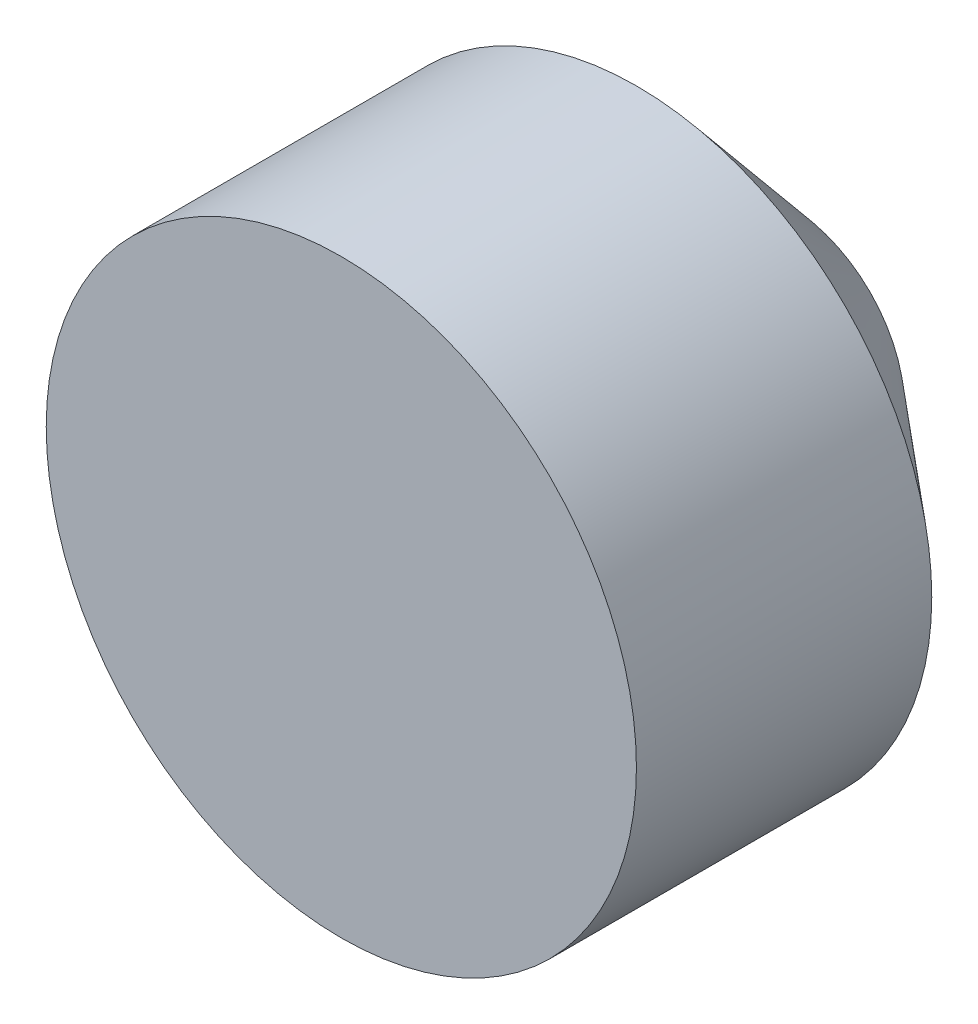
ISO-10303-21;
HEADER;
FILE_DESCRIPTION(('STEP AP214'),'2;1');
FILE_NAME('part.step','',(''),(''),'','','');
FILE_SCHEMA(('AUTOMOTIVE_DESIGN { 1 0 10303 214 1 1 1 1 }'));
ENDSEC;
DATA;
#1=APPLICATION_CONTEXT('core data for automotive mechanical design processes');
#2=APPLICATION_PROTOCOL_DEFINITION('international standard','automotive_design',2000,#1);
#3=PRODUCT_CONTEXT('',#1,'mechanical');
#4=PRODUCT('Part','Part','',(#3));
#5=PRODUCT_RELATED_PRODUCT_CATEGORY('part','',(#4));
#6=PRODUCT_DEFINITION_FORMATION('','',#4);
#7=PRODUCT_DEFINITION_CONTEXT('part definition',#1,'design');
#8=PRODUCT_DEFINITION('design','',#6,#7);
#9=PRODUCT_DEFINITION_SHAPE('','',#8);
#10=(LENGTH_UNIT() NAMED_UNIT(*) SI_UNIT(.MILLI.,.METRE.));
#11=(NAMED_UNIT(*) PLANE_ANGLE_UNIT() SI_UNIT($,.RADIAN.));
#12=(NAMED_UNIT(*) SI_UNIT($,.STERADIAN.) SOLID_ANGLE_UNIT());
#13=UNCERTAINTY_MEASURE_WITH_UNIT(LENGTH_MEASURE(1.E-05),#10,'distance_accuracy_value','');
#14=(GEOMETRIC_REPRESENTATION_CONTEXT(3) GLOBAL_UNCERTAINTY_ASSIGNED_CONTEXT((#13)) GLOBAL_UNIT_ASSIGNED_CONTEXT((#10,
#11,#12)) REPRESENTATION_CONTEXT('',''));
#15=CARTESIAN_POINT('',(0.,0.,0.));
#16=DIRECTION('',(0.,0.,1.));
#17=DIRECTION('',(1.,0.,0.));
#18=AXIS2_PLACEMENT_3D('',#15,#16,#17);
#19=CARTESIAN_POINT('',(0.,0.,0.));
#20=DIRECTION('',(0.,0.,1.));
#21=DIRECTION('',(0.,-1.,0.));
#22=AXIS2_PLACEMENT_3D('',#19,#20,#21);
#23=PLANE('',#22);
#24=CARTESIAN_POINT('',(0.,0.,0.));
#25=DIRECTION('',(0.,0.,-1.));
#26=DIRECTION('',(0.,1.,0.));
#27=AXIS2_PLACEMENT_3D('',#24,#25,#26);
#28=CIRCLE('',#27,500.);
#29=CARTESIAN_POINT('',(0.,500.,0.));
#30=VERTEX_POINT('',#29);
#31=EDGE_CURVE('E10',#30,#30,#28,.T.);
#32=ORIENTED_EDGE('',*,*,#31,.F.);
#33=EDGE_LOOP('',(#32));
#34=FACE_BOUND('',#33,.T.);
#35=ADVANCED_FACE('F39',(#34),#23,.T.);
#36=CARTESIAN_POINT('',(0.,0.,-754.38));
#37=DIRECTION('',(0.,0.,-1.));
#38=DIRECTION('',(0.,1.,0.));
#39=AXIS2_PLACEMENT_3D('',#36,#37,#38);
#40=CYLINDRICAL_SURFACE('',#39,500.);
#41=ORIENTED_EDGE('',*,*,#31,.T.);
#42=EDGE_LOOP('',(#41));
#43=FACE_BOUND('',#42,.T.);
#44=CARTESIAN_POINT('',(0.,0.,-500.38));
#45=DIRECTION('',(0.,0.,-1.));
#46=DIRECTION('',(0.,1.,0.));
#47=AXIS2_PLACEMENT_3D('',#44,#45,#46);
#48=CIRCLE('',#47,500.);
#49=CARTESIAN_POINT('',(0.,500.,-500.38));
#50=VERTEX_POINT('',#49);
#51=EDGE_CURVE('E46',#50,#50,#48,.T.);
#52=ORIENTED_EDGE('',*,*,#51,.F.);
#53=EDGE_LOOP('',(#52));
#54=FACE_BOUND('',#53,.T.);
#55=ADVANCED_FACE('F63',(#43,#54),#40,.T.);
#56=CARTESIAN_POINT('',(0.,0.,-754.38));
#57=DIRECTION('',(0.,0.,1.));
#58=DIRECTION('',(0.,-1.,0.));
#59=AXIS2_PLACEMENT_3D('',#56,#57,#58);
#60=CONICAL_SURFACE('',#59,200.,0.868240620272371);
#61=ORIENTED_EDGE('',*,*,#51,.T.);
#62=EDGE_LOOP('',(#61));
#63=FACE_BOUND('',#62,.T.);
#64=CARTESIAN_POINT('',(0.,0.,-754.38));
#65=DIRECTION('',(0.,0.,-1.));
#66=DIRECTION('',(0.,1.,0.));
#67=AXIS2_PLACEMENT_3D('',#64,#65,#66);
#68=CIRCLE('',#67,200.);
#69=CARTESIAN_POINT('',(0.,200.,-754.38));
#70=VERTEX_POINT('',#69);
#71=EDGE_CURVE('E51',#70,#70,#68,.T.);
#72=ORIENTED_EDGE('',*,*,#71,.F.);
#73=EDGE_LOOP('',(#72));
#74=FACE_BOUND('',#73,.T.);
#75=ADVANCED_FACE('F61',(#63,#74),#60,.T.);
#76=CARTESIAN_POINT('',(0.,200.,-754.38));
#77=DIRECTION('',(0.,0.,-1.));
#78=DIRECTION('',(0.,1.,0.));
#79=AXIS2_PLACEMENT_3D('',#76,#77,#78);
#80=PLANE('',#79);
#81=ORIENTED_EDGE('',*,*,#71,.T.);
#82=EDGE_LOOP('',(#81));
#83=FACE_BOUND('',#82,.T.);
#84=ADVANCED_FACE('F59',(#83),#80,.T.);
#85=CLOSED_SHELL('',(#35,#55,#75,#84));
#86=MANIFOLD_SOLID_BREP('B2',#85);
#87=ADVANCED_BREP_SHAPE_REPRESENTATION('',(#18,#86),#14);
#88=SHAPE_DEFINITION_REPRESENTATION(#9,#87);
ENDSEC;
END-ISO-10303-21;
